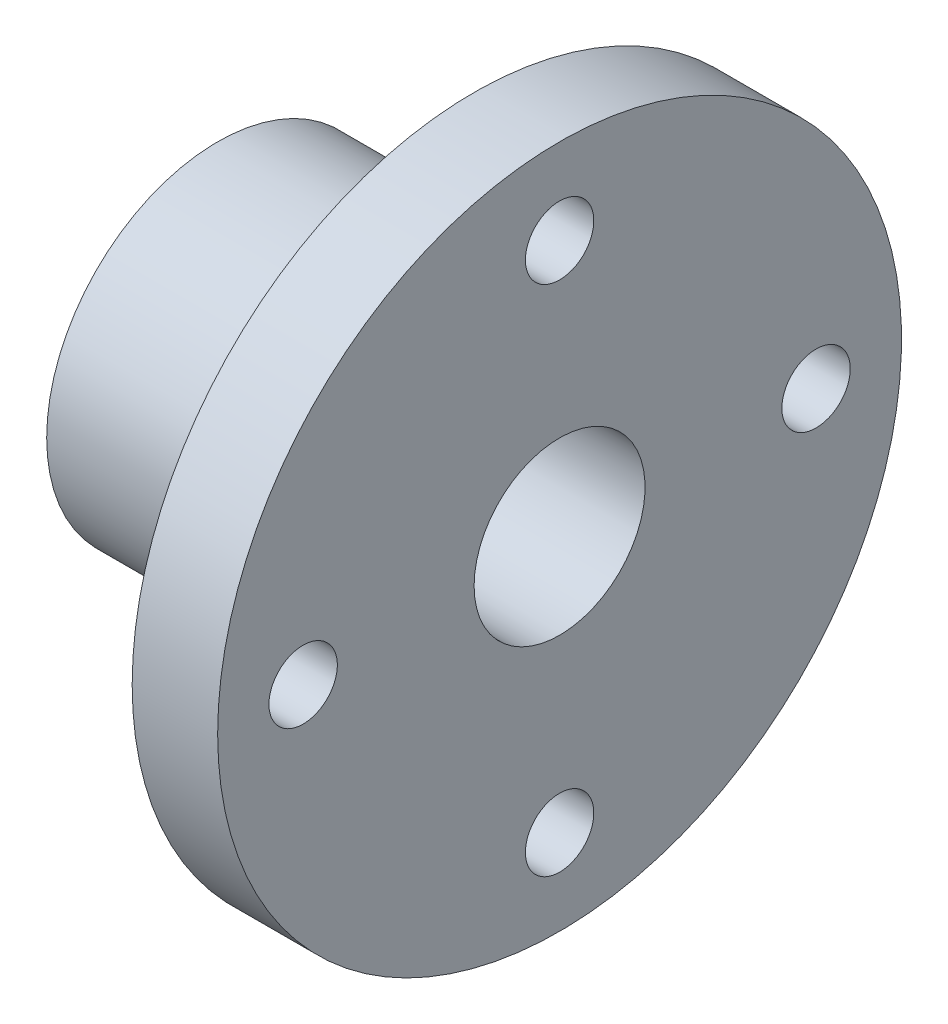
ISO-10303-21;
HEADER;
FILE_DESCRIPTION(('STEP AP214'),'2;1');
FILE_NAME('part.step','',(''),(''),'','','');
FILE_SCHEMA(('AUTOMOTIVE_DESIGN { 1 0 10303 214 1 1 1 1 }'));
ENDSEC;
DATA;
#1=APPLICATION_CONTEXT('core data for automotive mechanical design processes');
#2=APPLICATION_PROTOCOL_DEFINITION('international standard','automotive_design',2000,#1);
#3=PRODUCT_CONTEXT('',#1,'mechanical');
#4=PRODUCT('Part','Part','',(#3));
#5=PRODUCT_RELATED_PRODUCT_CATEGORY('part','',(#4));
#6=PRODUCT_DEFINITION_FORMATION('','',#4);
#7=PRODUCT_DEFINITION_CONTEXT('part definition',#1,'design');
#8=PRODUCT_DEFINITION('design','',#6,#7);
#9=PRODUCT_DEFINITION_SHAPE('','',#8);
#10=(LENGTH_UNIT() NAMED_UNIT(*) SI_UNIT(.MILLI.,.METRE.));
#11=(NAMED_UNIT(*) PLANE_ANGLE_UNIT() SI_UNIT($,.RADIAN.));
#12=(NAMED_UNIT(*) SI_UNIT($,.STERADIAN.) SOLID_ANGLE_UNIT());
#13=UNCERTAINTY_MEASURE_WITH_UNIT(LENGTH_MEASURE(1.E-05),#10,'distance_accuracy_value','');
#14=(GEOMETRIC_REPRESENTATION_CONTEXT(3) GLOBAL_UNCERTAINTY_ASSIGNED_CONTEXT((#13)) GLOBAL_UNIT_ASSIGNED_CONTEXT((#10,
#11,#12)) REPRESENTATION_CONTEXT('',''));
#15=CARTESIAN_POINT('',(0.,0.,0.));
#16=DIRECTION('',(0.,0.,1.));
#17=DIRECTION('',(1.,0.,0.));
#18=AXIS2_PLACEMENT_3D('',#15,#16,#17);
#19=CARTESIAN_POINT('',(11.4349315068493,0.,14.));
#20=DIRECTION('',(-1.,0.,0.));
#21=DIRECTION('',(0.,0.,1.));
#22=AXIS2_PLACEMENT_3D('',#19,#20,#21);
#23=PLANE('',#22);
#24=CARTESIAN_POINT('',(11.4349315068493,0.,-42.));
#25=DIRECTION('',(-1.,0.,0.));
#26=DIRECTION('',(0.,0.,1.));
#27=AXIS2_PLACEMENT_3D('',#24,#25,#26);
#28=CIRCLE('',#27,5.6);
#29=CARTESIAN_POINT('',(11.4349315068493,0.,-36.4));
#30=VERTEX_POINT('',#29);
#31=EDGE_CURVE('E78',#30,#30,#28,.F.);
#32=ORIENTED_EDGE('',*,*,#31,.F.);
#33=EDGE_LOOP('',(#32));
#34=FACE_BOUND('',#33,.T.);
#35=CARTESIAN_POINT('',(11.4349315068493,0.,42.));
#36=DIRECTION('',(-1.,0.,0.));
#37=DIRECTION('',(0.,0.,1.));
#38=AXIS2_PLACEMENT_3D('',#35,#36,#37);
#39=CIRCLE('',#38,5.6);
#40=CARTESIAN_POINT('',(11.4349315068493,0.,47.6));
#41=VERTEX_POINT('',#40);
#42=EDGE_CURVE('E64',#41,#41,#39,.F.);
#43=ORIENTED_EDGE('',*,*,#42,.F.);
#44=EDGE_LOOP('',(#43));
#45=FACE_BOUND('',#44,.T.);
#46=CARTESIAN_POINT('',(11.4349315068493,0.,0.));
#47=DIRECTION('',(-1.,0.,0.));
#48=DIRECTION('',(0.,0.,1.));
#49=AXIS2_PLACEMENT_3D('',#46,#47,#48);
#50=CIRCLE('',#49,56.);
#51=CARTESIAN_POINT('',(11.4349315068493,0.,56.));
#52=VERTEX_POINT('',#51);
#53=EDGE_CURVE('E45',#52,#52,#50,.T.);
#54=ORIENTED_EDGE('',*,*,#53,.F.);
#55=EDGE_LOOP('',(#54));
#56=FACE_BOUND('',#55,.T.);
#57=CARTESIAN_POINT('',(11.4349315068493,0.,0.));
#58=DIRECTION('',(-1.,0.,0.));
#59=DIRECTION('',(0.,0.,1.));
#60=AXIS2_PLACEMENT_3D('',#57,#58,#59);
#61=CIRCLE('',#60,14.);
#62=CARTESIAN_POINT('',(11.4349315068493,0.,14.));
#63=VERTEX_POINT('',#62);
#64=EDGE_CURVE('E10',#63,#63,#61,.T.);
#65=ORIENTED_EDGE('',*,*,#64,.T.);
#66=EDGE_LOOP('',(#65));
#67=FACE_BOUND('',#66,.T.);
#68=CARTESIAN_POINT('',(11.4349315068493,-42.,0.));
#69=DIRECTION('',(-1.,0.,0.));
#70=DIRECTION('',(0.,0.,1.));
#71=AXIS2_PLACEMENT_3D('',#68,#69,#70);
#72=CIRCLE('',#71,5.6);
#73=CARTESIAN_POINT('',(11.4349315068493,-42.,5.6));
#74=VERTEX_POINT('',#73);
#75=EDGE_CURVE('E71',#74,#74,#72,.F.);
#76=ORIENTED_EDGE('',*,*,#75,.F.);
#77=EDGE_LOOP('',(#76));
#78=FACE_BOUND('',#77,.T.);
#79=CARTESIAN_POINT('',(11.4349315068493,42.,0.));
#80=DIRECTION('',(-1.,0.,0.));
#81=DIRECTION('',(0.,0.,1.));
#82=AXIS2_PLACEMENT_3D('',#79,#80,#81);
#83=CIRCLE('',#82,5.6);
#84=CARTESIAN_POINT('',(11.4349315068493,42.,5.6));
#85=VERTEX_POINT('',#84);
#86=EDGE_CURVE('E85',#85,#85,#83,.F.);
#87=ORIENTED_EDGE('',*,*,#86,.F.);
#88=EDGE_LOOP('',(#87));
#89=FACE_BOUND('',#88,.T.);
#90=ADVANCED_FACE('F38',(#34,#45,#56,#67,#78,#89),#23,.F.);
#91=CARTESIAN_POINT('',(-2.5650684931507,0.,56.));
#92=DIRECTION('',(1.,0.,0.));
#93=DIRECTION('',(0.,0.,-1.));
#94=AXIS2_PLACEMENT_3D('',#91,#92,#93);
#95=PLANE('',#94);
#96=CARTESIAN_POINT('',(-2.5650684931507,0.,-42.));
#97=DIRECTION('',(1.,0.,0.));
#98=DIRECTION('',(0.,1.,0.));
#99=AXIS2_PLACEMENT_3D('',#96,#97,#98);
#100=CIRCLE('',#99,5.6);
#101=CARTESIAN_POINT('',(-2.5650684931507,5.6,-42.));
#102=VERTEX_POINT('',#101);
#103=EDGE_CURVE('E81',#102,#102,#100,.T.);
#104=ORIENTED_EDGE('',*,*,#103,.T.);
#105=EDGE_LOOP('',(#104));
#106=FACE_BOUND('',#105,.T.);
#107=CARTESIAN_POINT('',(-2.5650684931507,0.,42.));
#108=DIRECTION('',(1.,0.,0.));
#109=DIRECTION('',(0.,-1.,0.));
#110=AXIS2_PLACEMENT_3D('',#107,#108,#109);
#111=CIRCLE('',#110,5.6);
#112=CARTESIAN_POINT('',(-2.5650684931507,-5.6,42.));
#113=VERTEX_POINT('',#112);
#114=EDGE_CURVE('E67',#113,#113,#111,.T.);
#115=ORIENTED_EDGE('',*,*,#114,.T.);
#116=EDGE_LOOP('',(#115));
#117=FACE_BOUND('',#116,.T.);
#118=CARTESIAN_POINT('',(-2.5650684931507,0.,0.));
#119=DIRECTION('',(-1.,0.,0.));
#120=DIRECTION('',(0.,0.,1.));
#121=AXIS2_PLACEMENT_3D('',#118,#119,#120);
#122=CIRCLE('',#121,28.);
#123=CARTESIAN_POINT('',(-2.5650684931507,0.,28.));
#124=VERTEX_POINT('',#123);
#125=EDGE_CURVE('E53',#124,#124,#122,.T.);
#126=ORIENTED_EDGE('',*,*,#125,.F.);
#127=EDGE_LOOP('',(#126));
#128=FACE_BOUND('',#127,.T.);
#129=CARTESIAN_POINT('',(-2.5650684931507,0.,0.));
#130=DIRECTION('',(-1.,0.,0.));
#131=DIRECTION('',(0.,0.,1.));
#132=AXIS2_PLACEMENT_3D('',#129,#130,#131);
#133=CIRCLE('',#132,56.);
#134=CARTESIAN_POINT('',(-2.5650684931507,0.,56.));
#135=VERTEX_POINT('',#134);
#136=EDGE_CURVE('E49',#135,#135,#133,.T.);
#137=ORIENTED_EDGE('',*,*,#136,.T.);
#138=EDGE_LOOP('',(#137));
#139=FACE_BOUND('',#138,.T.);
#140=CARTESIAN_POINT('',(-2.5650684931507,-42.,0.));
#141=DIRECTION('',(1.,0.,0.));
#142=DIRECTION('',(0.,0.,-1.));
#143=AXIS2_PLACEMENT_3D('',#140,#141,#142);
#144=CIRCLE('',#143,5.6);
#145=CARTESIAN_POINT('',(-2.5650684931507,-42.,-5.6));
#146=VERTEX_POINT('',#145);
#147=EDGE_CURVE('E74',#146,#146,#144,.T.);
#148=ORIENTED_EDGE('',*,*,#147,.T.);
#149=EDGE_LOOP('',(#148));
#150=FACE_BOUND('',#149,.T.);
#151=CARTESIAN_POINT('',(-2.5650684931507,42.,0.));
#152=DIRECTION('',(1.,0.,0.));
#153=DIRECTION('',(0.,0.,1.));
#154=AXIS2_PLACEMENT_3D('',#151,#152,#153);
#155=CIRCLE('',#154,5.6);
#156=CARTESIAN_POINT('',(-2.5650684931507,42.,5.6));
#157=VERTEX_POINT('',#156);
#158=EDGE_CURVE('E88',#157,#157,#155,.T.);
#159=ORIENTED_EDGE('',*,*,#158,.T.);
#160=EDGE_LOOP('',(#159));
#161=FACE_BOUND('',#160,.T.);
#162=ADVANCED_FACE('F94',(#106,#117,#128,#139,#150,#161),#95,.F.);
#163=CARTESIAN_POINT('',(-156.565068493151,0.,0.));
#164=DIRECTION('',(-1.,0.,0.));
#165=DIRECTION('',(0.,0.,1.));
#166=AXIS2_PLACEMENT_3D('',#163,#164,#165);
#167=CYLINDRICAL_SURFACE('',#166,14.);
#168=ORIENTED_EDGE('',*,*,#64,.F.);
#169=EDGE_LOOP('',(#168));
#170=FACE_BOUND('',#169,.T.);
#171=CARTESIAN_POINT('',(-44.5650684931507,0.,0.));
#172=DIRECTION('',(-1.,0.,0.));
#173=DIRECTION('',(0.,0.,1.));
#174=AXIS2_PLACEMENT_3D('',#171,#172,#173);
#175=CIRCLE('',#174,14.);
#176=CARTESIAN_POINT('',(-44.5650684931507,0.,14.));
#177=VERTEX_POINT('',#176);
#178=EDGE_CURVE('E61',#177,#177,#175,.T.);
#179=ORIENTED_EDGE('',*,*,#178,.T.);
#180=EDGE_LOOP('',(#179));
#181=FACE_BOUND('',#180,.T.);
#182=ADVANCED_FACE('F40',(#170,#181),#167,.F.);
#183=CARTESIAN_POINT('',(-156.565068493151,0.,0.));
#184=DIRECTION('',(-1.,0.,0.));
#185=DIRECTION('',(0.,0.,1.));
#186=AXIS2_PLACEMENT_3D('',#183,#184,#185);
#187=CYLINDRICAL_SURFACE('',#186,56.);
#188=ORIENTED_EDGE('',*,*,#136,.F.);
#189=EDGE_LOOP('',(#188));
#190=FACE_BOUND('',#189,.T.);
#191=ORIENTED_EDGE('',*,*,#53,.T.);
#192=EDGE_LOOP('',(#191));
#193=FACE_BOUND('',#192,.T.);
#194=ADVANCED_FACE('F113',(#190,#193),#187,.T.);
#195=CARTESIAN_POINT('',(-156.565068493151,0.,0.));
#196=DIRECTION('',(-1.,0.,0.));
#197=DIRECTION('',(0.,0.,1.));
#198=AXIS2_PLACEMENT_3D('',#195,#196,#197);
#199=CYLINDRICAL_SURFACE('',#198,28.);
#200=CARTESIAN_POINT('',(-44.5650684931507,0.,0.));
#201=DIRECTION('',(-1.,0.,0.));
#202=DIRECTION('',(0.,0.,1.));
#203=AXIS2_PLACEMENT_3D('',#200,#201,#202);
#204=CIRCLE('',#203,28.);
#205=CARTESIAN_POINT('',(-44.5650684931507,0.,28.));
#206=VERTEX_POINT('',#205);
#207=EDGE_CURVE('E58',#206,#206,#204,.T.);
#208=ORIENTED_EDGE('',*,*,#207,.F.);
#209=EDGE_LOOP('',(#208));
#210=FACE_BOUND('',#209,.T.);
#211=ORIENTED_EDGE('',*,*,#125,.T.);
#212=EDGE_LOOP('',(#211));
#213=FACE_BOUND('',#212,.T.);
#214=ADVANCED_FACE('F115',(#210,#213),#199,.T.);
#215=CARTESIAN_POINT('',(-44.5650684931507,0.,28.));
#216=DIRECTION('',(1.,0.,0.));
#217=DIRECTION('',(0.,0.,-1.));
#218=AXIS2_PLACEMENT_3D('',#215,#216,#217);
#219=PLANE('',#218);
#220=ORIENTED_EDGE('',*,*,#178,.F.);
#221=EDGE_LOOP('',(#220));
#222=FACE_BOUND('',#221,.T.);
#223=ORIENTED_EDGE('',*,*,#207,.T.);
#224=EDGE_LOOP('',(#223));
#225=FACE_BOUND('',#224,.T.);
#226=ADVANCED_FACE('F120',(#222,#225),#219,.F.);
#227=CARTESIAN_POINT('',(130.784931506849,0.,42.));
#228=DIRECTION('',(-1.,0.,0.));
#229=DIRECTION('',(0.,0.,1.));
#230=AXIS2_PLACEMENT_3D('',#227,#228,#229);
#231=CYLINDRICAL_SURFACE('',#230,5.6);
#232=ORIENTED_EDGE('',*,*,#114,.F.);
#233=EDGE_LOOP('',(#232));
#234=FACE_BOUND('',#233,.T.);
#235=ORIENTED_EDGE('',*,*,#42,.T.);
#236=EDGE_LOOP('',(#235));
#237=FACE_BOUND('',#236,.T.);
#238=ADVANCED_FACE('F124',(#234,#237),#231,.F.);
#239=CARTESIAN_POINT('',(130.784931506849,-42.,0.));
#240=DIRECTION('',(-1.,0.,0.));
#241=DIRECTION('',(0.,0.,1.));
#242=AXIS2_PLACEMENT_3D('',#239,#240,#241);
#243=CYLINDRICAL_SURFACE('',#242,5.6);
#244=ORIENTED_EDGE('',*,*,#147,.F.);
#245=EDGE_LOOP('',(#244));
#246=FACE_BOUND('',#245,.T.);
#247=ORIENTED_EDGE('',*,*,#75,.T.);
#248=EDGE_LOOP('',(#247));
#249=FACE_BOUND('',#248,.T.);
#250=ADVANCED_FACE('F128',(#246,#249),#243,.F.);
#251=CARTESIAN_POINT('',(130.784931506849,0.,-42.));
#252=DIRECTION('',(-1.,0.,0.));
#253=DIRECTION('',(0.,0.,1.));
#254=AXIS2_PLACEMENT_3D('',#251,#252,#253);
#255=CYLINDRICAL_SURFACE('',#254,5.6);
#256=ORIENTED_EDGE('',*,*,#103,.F.);
#257=EDGE_LOOP('',(#256));
#258=FACE_BOUND('',#257,.T.);
#259=ORIENTED_EDGE('',*,*,#31,.T.);
#260=EDGE_LOOP('',(#259));
#261=FACE_BOUND('',#260,.T.);
#262=ADVANCED_FACE('F99',(#258,#261),#255,.F.);
#263=CARTESIAN_POINT('',(130.784931506849,42.,0.));
#264=DIRECTION('',(-1.,0.,0.));
#265=DIRECTION('',(0.,0.,1.));
#266=AXIS2_PLACEMENT_3D('',#263,#264,#265);
#267=CYLINDRICAL_SURFACE('',#266,5.6);
#268=ORIENTED_EDGE('',*,*,#158,.F.);
#269=EDGE_LOOP('',(#268));
#270=FACE_BOUND('',#269,.T.);
#271=ORIENTED_EDGE('',*,*,#86,.T.);
#272=EDGE_LOOP('',(#271));
#273=FACE_BOUND('',#272,.T.);
#274=ADVANCED_FACE('F96',(#270,#273),#267,.F.);
#275=CLOSED_SHELL('',(#90,#162,#182,#194,#214,#226,#238,#250,#262,#274));
#276=MANIFOLD_SOLID_BREP('B2',#275);
#277=ADVANCED_BREP_SHAPE_REPRESENTATION('',(#18,#276),#14);
#278=SHAPE_DEFINITION_REPRESENTATION(#9,#277);
ENDSEC;
END-ISO-10303-21;
